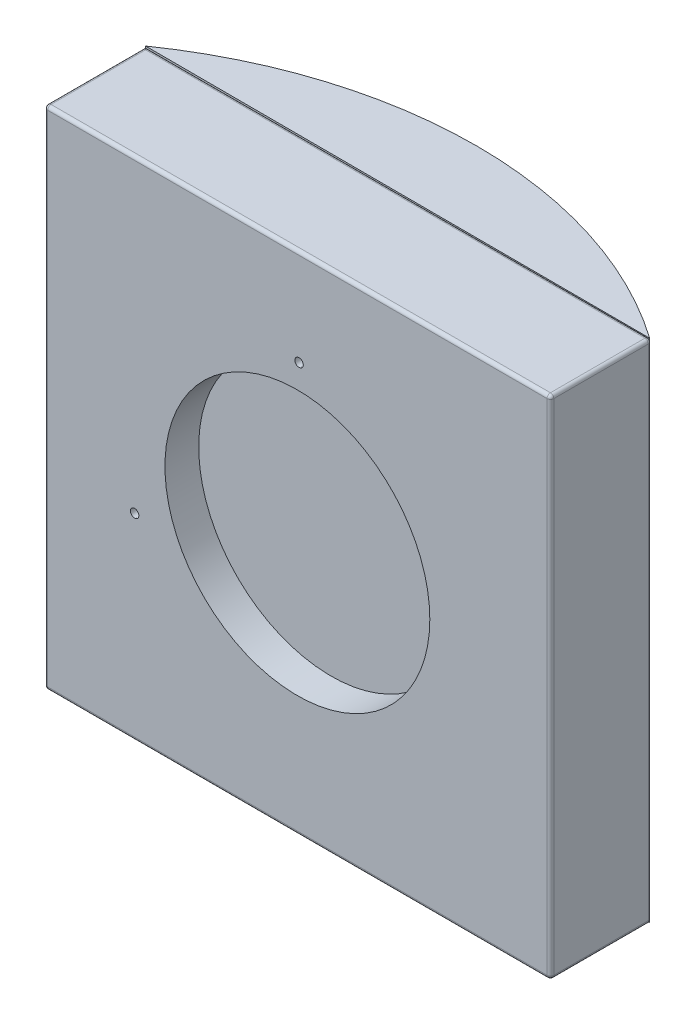
ISO-10303-21;
HEADER;
FILE_DESCRIPTION(('STEP AP214'),'2;1');
FILE_NAME('part.step','',(''),(''),'','','');
FILE_SCHEMA(('AUTOMOTIVE_DESIGN { 1 0 10303 214 1 1 1 1 }'));
ENDSEC;
DATA;
#1=APPLICATION_CONTEXT('core data for automotive mechanical design processes');
#2=APPLICATION_PROTOCOL_DEFINITION('international standard','automotive_design',2000,#1);
#3=PRODUCT_CONTEXT('',#1,'mechanical');
#4=PRODUCT('Part','Part','',(#3));
#5=PRODUCT_RELATED_PRODUCT_CATEGORY('part','',(#4));
#6=PRODUCT_DEFINITION_FORMATION('','',#4);
#7=PRODUCT_DEFINITION_CONTEXT('part definition',#1,'design');
#8=PRODUCT_DEFINITION('design','',#6,#7);
#9=PRODUCT_DEFINITION_SHAPE('','',#8);
#10=(LENGTH_UNIT() NAMED_UNIT(*) SI_UNIT(.MILLI.,.METRE.));
#11=(NAMED_UNIT(*) PLANE_ANGLE_UNIT() SI_UNIT($,.RADIAN.));
#12=(NAMED_UNIT(*) SI_UNIT($,.STERADIAN.) SOLID_ANGLE_UNIT());
#13=UNCERTAINTY_MEASURE_WITH_UNIT(LENGTH_MEASURE(1.E-05),#10,'distance_accuracy_value','');
#14=(GEOMETRIC_REPRESENTATION_CONTEXT(3) GLOBAL_UNCERTAINTY_ASSIGNED_CONTEXT((#13)) GLOBAL_UNIT_ASSIGNED_CONTEXT((#10,
#11,#12)) REPRESENTATION_CONTEXT('',''));
#15=CARTESIAN_POINT('',(0.,0.,0.));
#16=DIRECTION('',(0.,0.,1.));
#17=DIRECTION('',(1.,0.,0.));
#18=AXIS2_PLACEMENT_3D('',#15,#16,#17);
#19=CARTESIAN_POINT('',(74.,74.,-29.));
#20=DIRECTION('',(0.,1.,0.));
#21=DIRECTION('',(0.,0.,1.));
#22=AXIS2_PLACEMENT_3D('',#19,#20,#21);
#23=SPHERICAL_SURFACE('',#22,1.);
#24=CARTESIAN_POINT('',(74.4305291047432,73.9426271033344,-29.9007513756288));
#25=CARTESIAN_POINT('',(74.4278718002855,73.9517904499525,-29.9026067243922));
#26=CARTESIAN_POINT('',(74.4258625407038,73.9612301250531,-29.9040095217082));
#27=CARTESIAN_POINT('',(74.4231693323326,73.9803796203209,-29.9058897732701));
#28=CARTESIAN_POINT('',(74.4224843829785,73.990089230911,-29.9063679261186));
#29=CARTESIAN_POINT('',(74.4224649101891,74.0095152582604,-29.9063815148567));
#30=CARTESIAN_POINT('',(74.4231310111858,74.0192316760911,-29.9059165148374));
#31=CARTESIAN_POINT('',(74.4257929739684,74.0383874230766,-29.9040581007356));
#32=CARTESIAN_POINT('',(74.4277885681438,74.0478268075958,-29.9026648734936));
#33=CARTESIAN_POINT('',(74.4330515121115,74.0661618939257,-29.898990180103));
#34=CARTESIAN_POINT('',(74.4363187912206,74.0750576259223,-29.896708763322));
#35=CARTESIAN_POINT('',(74.4440308050954,74.0920557274952,-29.8913230360017));
#36=CARTESIAN_POINT('',(74.4484757284958,74.1001579696858,-29.8882185936304));
#37=CARTESIAN_POINT('',(74.4584175670713,74.1153440901568,-29.8812738230502));
#38=CARTESIAN_POINT('',(74.4639150765944,74.1224273891093,-29.8774330790832));
#39=CARTESIAN_POINT('',(74.4758026999076,74.1353719993852,-29.8691263891262));
#40=CARTESIAN_POINT('',(74.4821927689403,74.1412333719451,-29.8646604744854));
#41=CARTESIAN_POINT('',(74.4957086562992,74.151590852187,-29.8552124212487));
#42=CARTESIAN_POINT('',(74.5028370392789,74.156081971459,-29.8502284829871));
#43=CARTESIAN_POINT('',(74.5176081238788,74.163545935225,-29.8398986336474));
#44=CARTESIAN_POINT('',(74.5252508462641,74.1665187183782,-29.8345527079548));
#45=CARTESIAN_POINT('',(74.5408608471311,74.1708711230936,-29.8236312242814));
#46=CARTESIAN_POINT('',(74.5488291274053,74.1722453724311,-29.8180549568142));
#47=CARTESIAN_POINT('',(74.5648404515405,74.1733446195535,-29.8068473868675));
#48=CARTESIAN_POINT('',(74.5728834963299,74.173069596833,-29.8012160837046));
#49=CARTESIAN_POINT('',(74.588830406748,74.1708759903868,-29.7900482691596));
#50=CARTESIAN_POINT('',(74.5967340134067,74.1689546220742,-29.7845119345967));
#51=CARTESIAN_POINT('',(74.6121632554124,74.1635180012685,-29.7737015771849));
#52=CARTESIAN_POINT('',(74.6196888983268,74.1600027807014,-29.7684275490841));
#53=CARTESIAN_POINT('',(74.6341423103896,74.1514797546361,-29.7582963716963));
#54=CARTESIAN_POINT('',(74.6410705281354,74.1464730818552,-29.7534389096316));
#55=CARTESIAN_POINT('',(74.6541374768035,74.1351061096982,-29.7442758105373));
#56=CARTESIAN_POINT('',(74.6602761674178,74.1287457412553,-29.7399702016819));
#57=CARTESIAN_POINT('',(74.6715707545084,74.1148706125174,-29.7320470704562));
#58=CARTESIAN_POINT('',(74.6767293494936,74.1073591278767,-29.7284276588312));
#59=CARTESIAN_POINT('',(74.685935280188,74.0913826670844,-29.7219677375932));
#60=CARTESIAN_POINT('',(74.6899828107235,74.0829178584669,-29.7191270914229));
#61=CARTESIAN_POINT('',(74.696837146676,74.0653078278998,-29.714316159302));
#62=CARTESIAN_POINT('',(74.6996485057801,74.0561652506666,-29.7123426789892));
#63=CARTESIAN_POINT('',(74.7039718192039,74.0374303598477,-29.7093077165613));
#64=CARTESIAN_POINT('',(74.7054835436585,74.0278379670199,-29.708246395779));
#65=CARTESIAN_POINT('',(74.7071576110133,74.0085123955182,-29.707071102787));
#66=CARTESIAN_POINT('',(74.7073245333113,73.9987798077856,-29.7069539155594));
#67=CARTESIAN_POINT('',(74.7063239882313,73.9794103786518,-29.707656345545));
#68=CARTESIAN_POINT('',(74.705155489279,73.9697736170773,-29.7084766869721));
#69=CARTESIAN_POINT('',(74.7033206427212,73.9603267742203,-29.7097648263181));
#70=B_SPLINE_CURVE_WITH_KNOTS('',3,(#24,#25,#26,#27,#28,#29,#30,#31,#32,#33,#34,#35,#36,#37,#38,
#39,#40,#41,#42,#43,#44,#45,#46,#47,#48,#49,#50,#51,#52,#53,#54,#55,#56,#57,#58,#59,#60,#61,#62,
#63,#64,#65,#66,#67,#68,#69),.UNSPECIFIED.,.F.,.F.,(4,2,2,2,2,2,2,2,2,2,2,2,2,2,2,2,2,2,2,2,2,2,
4),(0.,0.0291201559340711,0.0582183019182402,0.0873298996247915,0.116435639298685,
0.145539761441217,0.174648548290671,0.20377382029324,0.232897632335231,0.262126238223692,
0.291356024854758,0.320683763367957,0.350011866514414,0.379389672602993,0.408766890259118,
0.438121853355839,0.467478314528448,0.496752738164597,0.526022025211897,0.555182570710872,
0.5843482727456,0.613414615892765,0.642503427133676),.UNSPECIFIED.);
#71=CARTESIAN_POINT('',(74.7071067811865,74.,-29.7071067811865));
#72=VERTEX_POINT('',#71);
#73=CARTESIAN_POINT('',(74.42247455372,74.,-29.9063747853173));
#74=VERTEX_POINT('',#73);
#75=EDGE_CURVE('E245',#72,#74,#70,.F.);
#76=ORIENTED_EDGE('',*,*,#75,.F.);
#77=CARTESIAN_POINT('',(74.,74.,-29.));
#78=DIRECTION('',(0.,1.,0.));
#79=DIRECTION('',(0.,0.,1.));
#80=AXIS2_PLACEMENT_3D('',#77,#78,#79);
#81=CIRCLE('',#80,1.);
#82=EDGE_CURVE('E316',#74,#72,#81,.F.);
#83=ORIENTED_EDGE('',*,*,#82,.F.);
#84=EDGE_LOOP('',(#76,#83));
#85=FACE_BOUND('',#84,.T.);
#86=ADVANCED_FACE('F41',(#85),#23,.T.);
#87=CARTESIAN_POINT('',(74.,-74.,-30.));
#88=DIRECTION('',(0.,0.,1.));
#89=DIRECTION('',(1.,0.,0.));
#90=AXIS2_PLACEMENT_3D('',#87,#88,#89);
#91=CYLINDRICAL_SURFACE('',#90,1.);
#92=CARTESIAN_POINT('',(74.0376484217508,-74.9992910468626,-30.174));
#93=CARTESIAN_POINT('',(74.1085266238928,-74.9966066602398,-30.1249014323537));
#94=CARTESIAN_POINT('',(74.1793009440295,-74.9863937068158,-30.0757612489331));
#95=CARTESIAN_POINT('',(74.3160348463956,-74.9512972572264,-29.9806329564631));
#96=CARTESIAN_POINT('',(74.3820750407225,-74.9268595873546,-29.9345945603016));
#97=CARTESIAN_POINT('',(74.4921868254143,-74.87203781748,-29.8576894517446));
#98=CARTESIAN_POINT('',(74.5373985806045,-74.8450084510917,-29.8260663272199));
#99=CARTESIAN_POINT('',(74.6250254363569,-74.7824962823509,-29.76470073019));
#100=CARTESIAN_POINT('',(74.6673551849175,-74.7468376530168,-29.7350162662021));
#101=CARTESIAN_POINT('',(74.7071067811866,-74.7071067811865,-29.7071067811865));
#102=B_SPLINE_CURVE_WITH_KNOTS('',3,(#92,#93,#94,#95,#96,#97,#98,#99,#100,#101),.UNSPECIFIED.,
.F.,.F.,(4,2,2,2,4),(0.,0.258756501097866,0.509809262671669,0.693502415615878,
0.881311113694212),.UNSPECIFIED.);
#103=CARTESIAN_POINT('',(74.4224745537198,-74.9063747853175,-29.9063747853174));
#104=VERTEX_POINT('',#103);
#105=CARTESIAN_POINT('',(74.7071067811865,-74.7071067811865,-29.7071067811865));
#106=VERTEX_POINT('',#105);
#107=EDGE_CURVE('E11',#104,#106,#102,.T.);
#108=ORIENTED_EDGE('',*,*,#107,.F.);
#109=CARTESIAN_POINT('',(74.,-74.,-29.));
#110=DIRECTION('',(0.,-0.707106781186547,0.707106781186547));
#111=DIRECTION('',(0.,-0.707106781186547,-0.707106781186547));
#112=AXIS2_PLACEMENT_3D('',#109,#110,#111);
#113=ELLIPSE('',#112,1.41421356237309,1.);
#114=EDGE_CURVE('E522',#104,#106,#113,.T.);
#115=ORIENTED_EDGE('',*,*,#114,.T.);
#116=EDGE_LOOP('',(#108,#115));
#117=FACE_BOUND('',#116,.T.);
#118=ADVANCED_FACE('F304',(#117),#91,.T.);
#119=CARTESIAN_POINT('',(-75.,-75.,-30.));
#120=DIRECTION('',(0.,-1.,0.));
#121=DIRECTION('',(0.,0.,-1.));
#122=AXIS2_PLACEMENT_3D('',#119,#120,#121);
#123=PLANE('',#122);
#124=DIRECTION('',(0.,0.,1.));
#125=VECTOR('',#124,1.);
#126=CARTESIAN_POINT('',(-74.,-75.,-30.));
#127=LINE('',#126,#125);
#128=CARTESIAN_POINT('',(-74.,-75.,-1.));
#129=VERTEX_POINT('',#128);
#130=CARTESIAN_POINT('',(-74.,-75.,-29.9980435583513));
#131=VERTEX_POINT('',#130);
#132=EDGE_CURVE('E547',#129,#131,#127,.F.);
#133=ORIENTED_EDGE('',*,*,#132,.T.);
#134=DIRECTION('',(-0.999998086173532,0.,-0.0019564379044126));
#135=VECTOR('',#134,1.);
#136=CARTESIAN_POINT('',(-75.,-75.,-30.));
#137=LINE('',#136,#135);
#138=CARTESIAN_POINT('',(-75.,-75.,-30.));
#139=VERTEX_POINT('',#138);
#140=EDGE_CURVE('E203',#131,#139,#137,.T.);
#141=ORIENTED_EDGE('',*,*,#140,.T.);
#142=CARTESIAN_POINT('',(-0.355908566276825,-75.,77.2091627445867));
#143=DIRECTION('',(0.,-1.,0.));
#144=DIRECTION('',(0.,0.,-1.));
#145=AXIS2_PLACEMENT_3D('',#142,#143,#144);
#146=CIRCLE('',#145,130.635159747907);
#147=CARTESIAN_POINT('',(74.7071067811865,-75.,-29.7071067811865));
#148=VERTEX_POINT('',#147);
#149=EDGE_CURVE('E195',#139,#148,#146,.T.);
#150=ORIENTED_EDGE('',*,*,#149,.T.);
#151=CARTESIAN_POINT('',(74.,-75.,-29.7084901943433));
#152=VERTEX_POINT('',#151);
#153=EDGE_CURVE('E64',#148,#152,#137,.T.);
#154=ORIENTED_EDGE('',*,*,#153,.T.);
#155=DIRECTION('',(0.,0.,1.));
#156=VECTOR('',#155,1.);
#157=CARTESIAN_POINT('',(74.,-75.,-30.));
#158=LINE('',#157,#156);
#159=CARTESIAN_POINT('',(74.,-75.,-1.));
#160=VERTEX_POINT('',#159);
#161=EDGE_CURVE('E538',#152,#160,#158,.T.);
#162=ORIENTED_EDGE('',*,*,#161,.T.);
#163=DIRECTION('',(1.,0.,0.));
#164=VECTOR('',#163,1.);
#165=CARTESIAN_POINT('',(-75.,-75.,-1.));
#166=LINE('',#165,#164);
#167=EDGE_CURVE('E598',#160,#129,#166,.F.);
#168=ORIENTED_EDGE('',*,*,#167,.T.);
#169=EDGE_LOOP('',(#133,#141,#150,#154,#162,#168));
#170=FACE_BOUND('',#169,.T.);
#171=ADVANCED_FACE('F309',(#170),#123,.T.);
#172=CARTESIAN_POINT('',(-75.,-75.,-30.));
#173=DIRECTION('',(1.,0.,0.));
#174=DIRECTION('',(0.,0.,-1.));
#175=AXIS2_PLACEMENT_3D('',#172,#173,#174);
#176=PLANE('',#175);
#177=DIRECTION('',(0.,1.,0.));
#178=VECTOR('',#177,1.);
#179=CARTESIAN_POINT('',(-75.,-75.,-30.));
#180=LINE('',#179,#178);
#181=CARTESIAN_POINT('',(-75.,-74.,-30.));
#182=VERTEX_POINT('',#181);
#183=CARTESIAN_POINT('',(-74.9999999999996,74.,-30.));
#184=VERTEX_POINT('',#183);
#185=EDGE_CURVE('E381',#182,#184,#180,.T.);
#186=ORIENTED_EDGE('',*,*,#185,.F.);
#187=DIRECTION('',(0.,0.,1.));
#188=VECTOR('',#187,1.);
#189=CARTESIAN_POINT('',(-75.,-74.,0.));
#190=LINE('',#189,#188);
#191=CARTESIAN_POINT('',(-75.,-74.,-1.));
#192=VERTEX_POINT('',#191);
#193=EDGE_CURVE('E621',#182,#192,#190,.T.);
#194=ORIENTED_EDGE('',*,*,#193,.T.);
#195=DIRECTION('',(0.,1.,0.));
#196=VECTOR('',#195,1.);
#197=CARTESIAN_POINT('',(-75.,75.,-1.));
#198=LINE('',#197,#196);
#199=CARTESIAN_POINT('',(-75.,74.,-1.));
#200=VERTEX_POINT('',#199);
#201=EDGE_CURVE('E614',#192,#200,#198,.T.);
#202=ORIENTED_EDGE('',*,*,#201,.T.);
#203=DIRECTION('',(0.,0.,1.));
#204=VECTOR('',#203,1.);
#205=CARTESIAN_POINT('',(-75.,74.,-30.));
#206=LINE('',#205,#204);
#207=EDGE_CURVE('E617',#200,#184,#206,.F.);
#208=ORIENTED_EDGE('',*,*,#207,.T.);
#209=EDGE_LOOP('',(#186,#194,#202,#208));
#210=FACE_BOUND('',#209,.T.);
#211=ADVANCED_FACE('F459',(#210),#176,.F.);
#212=CARTESIAN_POINT('',(-75.,75.,-30.));
#213=DIRECTION('',(0.,-1.,0.));
#214=DIRECTION('',(0.,0.,-1.));
#215=AXIS2_PLACEMENT_3D('',#212,#213,#214);
#216=PLANE('',#215);
#217=DIRECTION('',(1.,0.,0.));
#218=VECTOR('',#217,1.);
#219=CARTESIAN_POINT('',(-75.,75.,-29.));
#220=LINE('',#219,#218);
#221=CARTESIAN_POINT('',(74.,75.,-29.));
#222=VERTEX_POINT('',#221);
#223=CARTESIAN_POINT('',(-74.,75.,-29.));
#224=VERTEX_POINT('',#223);
#225=EDGE_CURVE('E507',#222,#224,#220,.F.);
#226=ORIENTED_EDGE('',*,*,#225,.T.);
#227=DIRECTION('',(0.,0.,1.));
#228=VECTOR('',#227,1.);
#229=CARTESIAN_POINT('',(-74.,75.,-30.));
#230=LINE('',#229,#228);
#231=CARTESIAN_POINT('',(-74.,75.,-1.));
#232=VERTEX_POINT('',#231);
#233=EDGE_CURVE('E501',#224,#232,#230,.T.);
#234=ORIENTED_EDGE('',*,*,#233,.T.);
#235=DIRECTION('',(1.,0.,0.));
#236=VECTOR('',#235,1.);
#237=CARTESIAN_POINT('',(75.,75.,-1.));
#238=LINE('',#237,#236);
#239=CARTESIAN_POINT('',(74.,75.,-1.));
#240=VERTEX_POINT('',#239);
#241=EDGE_CURVE('E496',#232,#240,#238,.T.);
#242=ORIENTED_EDGE('',*,*,#241,.T.);
#243=DIRECTION('',(0.,0.,1.));
#244=VECTOR('',#243,1.);
#245=CARTESIAN_POINT('',(74.,75.,-30.));
#246=LINE('',#245,#244);
#247=EDGE_CURVE('E626',#240,#222,#246,.F.);
#248=ORIENTED_EDGE('',*,*,#247,.T.);
#249=EDGE_LOOP('',(#226,#234,#242,#248));
#250=FACE_BOUND('',#249,.T.);
#251=ADVANCED_FACE('F462',(#250),#216,.F.);
#252=CARTESIAN_POINT('',(75.,-75.,-30.));
#253=DIRECTION('',(1.,0.,0.));
#254=DIRECTION('',(0.,0.,-1.));
#255=AXIS2_PLACEMENT_3D('',#252,#253,#254);
#256=PLANE('',#255);
#257=DIRECTION('',(0.,1.,0.));
#258=VECTOR('',#257,1.);
#259=CARTESIAN_POINT('',(75.,-75.,-1.));
#260=LINE('',#259,#258);
#261=CARTESIAN_POINT('',(75.,74.,-1.));
#262=VERTEX_POINT('',#261);
#263=CARTESIAN_POINT('',(75.,-74.,-1.));
#264=VERTEX_POINT('',#263);
#265=EDGE_CURVE('E492',#262,#264,#260,.F.);
#266=ORIENTED_EDGE('',*,*,#265,.T.);
#267=DIRECTION('',(0.,0.,1.));
#268=VECTOR('',#267,1.);
#269=CARTESIAN_POINT('',(75.,-74.,-30.));
#270=LINE('',#269,#268);
#271=CARTESIAN_POINT('',(75.,-74.,-29.));
#272=VERTEX_POINT('',#271);
#273=EDGE_CURVE('E536',#264,#272,#270,.F.);
#274=ORIENTED_EDGE('',*,*,#273,.T.);
#275=DIRECTION('',(0.,1.,0.));
#276=VECTOR('',#275,1.);
#277=CARTESIAN_POINT('',(75.,75.,-29.));
#278=LINE('',#277,#276);
#279=CARTESIAN_POINT('',(75.,74.,-29.));
#280=VERTEX_POINT('',#279);
#281=EDGE_CURVE('E532',#272,#280,#278,.T.);
#282=ORIENTED_EDGE('',*,*,#281,.T.);
#283=DIRECTION('',(0.,0.,1.));
#284=VECTOR('',#283,1.);
#285=CARTESIAN_POINT('',(75.,74.,0.));
#286=LINE('',#285,#284);
#287=EDGE_CURVE('E607',#280,#262,#286,.T.);
#288=ORIENTED_EDGE('',*,*,#287,.T.);
#289=EDGE_LOOP('',(#266,#274,#282,#288));
#290=FACE_BOUND('',#289,.T.);
#291=ADVANCED_FACE('F457',(#290),#256,.T.);
#292=CARTESIAN_POINT('',(0.,0.,0.));
#293=DIRECTION('',(0.,0.,1.));
#294=DIRECTION('',(1.,0.,0.));
#295=AXIS2_PLACEMENT_3D('',#292,#293,#294);
#296=PLANE('',#295);
#297=CARTESIAN_POINT('',(0.496213053365321,46.5,0.));
#298=DIRECTION('',(0.,0.,1.));
#299=DIRECTION('',(1.,0.,0.));
#300=AXIS2_PLACEMENT_3D('',#297,#298,#299);
#301=CIRCLE('',#300,1.24999999999999);
#302=CARTESIAN_POINT('',(1.74621305336531,46.5,0.));
#303=VERTEX_POINT('',#302);
#304=EDGE_CURVE('E182',#303,#303,#301,.T.);
#305=ORIENTED_EDGE('',*,*,#304,.F.);
#306=EDGE_LOOP('',(#305));
#307=FACE_BOUND('',#306,.T.);
#308=CARTESIAN_POINT('',(-48.2375471335506,-16.5472529741879,0.));
#309=DIRECTION('',(0.,0.,1.));
#310=DIRECTION('',(1.,0.,0.));
#311=AXIS2_PLACEMENT_3D('',#308,#309,#310);
#312=CIRCLE('',#311,1.24999999999999);
#313=CARTESIAN_POINT('',(-46.9875471335506,-16.5472529741879,0.));
#314=VERTEX_POINT('',#313);
#315=EDGE_CURVE('E181',#314,#314,#312,.T.);
#316=ORIENTED_EDGE('',*,*,#315,.F.);
#317=EDGE_LOOP('',(#316));
#318=FACE_BOUND('',#317,.T.);
#319=CARTESIAN_POINT('',(0.,0.,0.));
#320=DIRECTION('',(0.,0.,1.));
#321=DIRECTION('',(1.,0.,0.));
#322=AXIS2_PLACEMENT_3D('',#319,#320,#321);
#323=CIRCLE('',#322,39.25);
#324=CARTESIAN_POINT('',(39.25,0.,0.));
#325=VERTEX_POINT('',#324);
#326=EDGE_CURVE('E586',#325,#325,#323,.T.);
#327=ORIENTED_EDGE('',*,*,#326,.F.);
#328=EDGE_LOOP('',(#327));
#329=FACE_BOUND('',#328,.T.);
#330=DIRECTION('',(0.,1.,0.));
#331=VECTOR('',#330,1.);
#332=CARTESIAN_POINT('',(-74.,-75.,0.));
#333=LINE('',#332,#331);
#334=CARTESIAN_POINT('',(-74.,74.,0.));
#335=VERTEX_POINT('',#334);
#336=CARTESIAN_POINT('',(-74.,-74.,0.));
#337=VERTEX_POINT('',#336);
#338=EDGE_CURVE('E72',#335,#337,#333,.F.);
#339=ORIENTED_EDGE('',*,*,#338,.T.);
#340=DIRECTION('',(1.,0.,0.));
#341=VECTOR('',#340,1.);
#342=CARTESIAN_POINT('',(0.,-74.,0.));
#343=LINE('',#342,#341);
#344=CARTESIAN_POINT('',(74.,-74.,0.));
#345=VERTEX_POINT('',#344);
#346=EDGE_CURVE('E57',#337,#345,#343,.T.);
#347=ORIENTED_EDGE('',*,*,#346,.T.);
#348=DIRECTION('',(0.,1.,0.));
#349=VECTOR('',#348,1.);
#350=CARTESIAN_POINT('',(74.,0.,0.));
#351=LINE('',#350,#349);
#352=CARTESIAN_POINT('',(74.,74.,0.));
#353=VERTEX_POINT('',#352);
#354=EDGE_CURVE('E491',#345,#353,#351,.T.);
#355=ORIENTED_EDGE('',*,*,#354,.T.);
#356=DIRECTION('',(1.,0.,0.));
#357=VECTOR('',#356,1.);
#358=CARTESIAN_POINT('',(-75.,74.,0.));
#359=LINE('',#358,#357);
#360=EDGE_CURVE('E498',#353,#335,#359,.F.);
#361=ORIENTED_EDGE('',*,*,#360,.T.);
#362=EDGE_LOOP('',(#339,#347,#355,#361));
#363=FACE_BOUND('',#362,.T.);
#364=ADVANCED_FACE('F300',(#307,#318,#329,#363),#296,.T.);
#365=CARTESIAN_POINT('',(-74.,74.,-1.));
#366=DIRECTION('',(-1.,0.,0.));
#367=DIRECTION('',(0.,0.,1.));
#368=AXIS2_PLACEMENT_3D('',#365,#366,#367);
#369=SPHERICAL_SURFACE('',#368,1.);
#370=CARTESIAN_POINT('',(-74.,74.,-1.));
#371=DIRECTION('',(-1.,0.,0.));
#372=DIRECTION('',(0.,0.,1.));
#373=AXIS2_PLACEMENT_3D('',#370,#371,#372);
#374=CIRCLE('',#373,1.);
#375=EDGE_CURVE('E371',#232,#335,#374,.F.);
#376=ORIENTED_EDGE('',*,*,#375,.F.);
#377=CARTESIAN_POINT('',(-74.,74.,-1.));
#378=DIRECTION('',(0.,0.,1.));
#379=DIRECTION('',(1.,0.,0.));
#380=AXIS2_PLACEMENT_3D('',#377,#378,#379);
#381=CIRCLE('',#380,1.);
#382=EDGE_CURVE('E379',#200,#232,#381,.F.);
#383=ORIENTED_EDGE('',*,*,#382,.F.);
#384=CARTESIAN_POINT('',(-74.,74.,-1.));
#385=DIRECTION('',(0.,1.,0.));
#386=DIRECTION('',(0.,0.,1.));
#387=AXIS2_PLACEMENT_3D('',#384,#385,#386);
#388=CIRCLE('',#387,1.);
#389=EDGE_CURVE('E375',#335,#200,#388,.F.);
#390=ORIENTED_EDGE('',*,*,#389,.F.);
#391=EDGE_LOOP('',(#376,#383,#390));
#392=FACE_BOUND('',#391,.T.);
#393=ADVANCED_FACE('F43',(#392),#369,.T.);
#394=CARTESIAN_POINT('',(-74.,74.,-30.));
#395=DIRECTION('',(0.,0.,1.));
#396=DIRECTION('',(1.,0.,0.));
#397=AXIS2_PLACEMENT_3D('',#394,#395,#396);
#398=CYLINDRICAL_SURFACE('',#397,1.);
#399=ORIENTED_EDGE('',*,*,#382,.T.);
#400=ORIENTED_EDGE('',*,*,#233,.F.);
#401=CARTESIAN_POINT('',(-74.,74.,-29.));
#402=DIRECTION('',(0.707106781186547,0.,-0.707106781186547));
#403=DIRECTION('',(0.707106781186547,0.,0.707106781186547));
#404=AXIS2_PLACEMENT_3D('',#401,#402,#403);
#405=ELLIPSE('',#404,1.41421356237309,1.);
#406=EDGE_CURVE('E367',#184,#224,#405,.T.);
#407=ORIENTED_EDGE('',*,*,#406,.F.);
#408=ORIENTED_EDGE('',*,*,#207,.F.);
#409=EDGE_LOOP('',(#399,#400,#407,#408));
#410=FACE_BOUND('',#409,.T.);
#411=ADVANCED_FACE('F293',(#410),#398,.T.);
#412=CARTESIAN_POINT('',(-74.,-74.,-30.));
#413=DIRECTION('',(0.,0.,-1.));
#414=DIRECTION('',(-1.,0.,0.));
#415=AXIS2_PLACEMENT_3D('',#412,#413,#414);
#416=CYLINDRICAL_SURFACE('',#415,1.);
#417=CARTESIAN_POINT('',(-74.,-74.,-29.9980435583513));
#418=DIRECTION('',(-0.0019564379044126,0.,0.999998086173532));
#419=DIRECTION('',(-0.999998086173532,0.,-0.0019564379044126));
#420=AXIS2_PLACEMENT_3D('',#417,#418,#419);
#421=ELLIPSE('',#420,1.00000191383013,1.);
#422=EDGE_CURVE('E239',#131,#182,#421,.F.);
#423=ORIENTED_EDGE('',*,*,#422,.F.);
#424=ORIENTED_EDGE('',*,*,#132,.F.);
#425=CARTESIAN_POINT('',(-74.,-74.,-1.));
#426=DIRECTION('',(0.,0.,1.));
#427=DIRECTION('',(0.,-1.,0.));
#428=AXIS2_PLACEMENT_3D('',#425,#426,#427);
#429=CIRCLE('',#428,1.);
#430=EDGE_CURVE('E363',#192,#129,#429,.T.);
#431=ORIENTED_EDGE('',*,*,#430,.F.);
#432=ORIENTED_EDGE('',*,*,#193,.F.);
#433=EDGE_LOOP('',(#423,#424,#431,#432));
#434=FACE_BOUND('',#433,.T.);
#435=ADVANCED_FACE('F290',(#434),#416,.T.);
#436=CARTESIAN_POINT('',(-74.,-75.,-1.));
#437=DIRECTION('',(0.,-1.,0.));
#438=DIRECTION('',(0.,0.,-1.));
#439=AXIS2_PLACEMENT_3D('',#436,#437,#438);
#440=CYLINDRICAL_SURFACE('',#439,1.);
#441=ORIENTED_EDGE('',*,*,#389,.T.);
#442=ORIENTED_EDGE('',*,*,#201,.F.);
#443=CARTESIAN_POINT('',(-74.,-74.,-1.));
#444=DIRECTION('',(0.,-1.,0.));
#445=DIRECTION('',(0.,0.,-1.));
#446=AXIS2_PLACEMENT_3D('',#443,#444,#445);
#447=CIRCLE('',#446,1.);
#448=EDGE_CURVE('E359',#337,#192,#447,.T.);
#449=ORIENTED_EDGE('',*,*,#448,.F.);
#450=ORIENTED_EDGE('',*,*,#338,.F.);
#451=EDGE_LOOP('',(#441,#442,#449,#450));
#452=FACE_BOUND('',#451,.T.);
#453=ADVANCED_FACE('F286',(#452),#440,.T.);
#454=CARTESIAN_POINT('',(-75.,74.,-1.));
#455=DIRECTION('',(-1.,0.,0.));
#456=DIRECTION('',(0.,0.,1.));
#457=AXIS2_PLACEMENT_3D('',#454,#455,#456);
#458=CYLINDRICAL_SURFACE('',#457,1.);
#459=ORIENTED_EDGE('',*,*,#375,.T.);
#460=ORIENTED_EDGE('',*,*,#360,.F.);
#461=CARTESIAN_POINT('',(74.,74.,-1.));
#462=DIRECTION('',(1.,0.,0.));
#463=DIRECTION('',(0.,0.,-1.));
#464=AXIS2_PLACEMENT_3D('',#461,#462,#463);
#465=CIRCLE('',#464,1.);
#466=EDGE_CURVE('E355',#240,#353,#465,.T.);
#467=ORIENTED_EDGE('',*,*,#466,.F.);
#468=ORIENTED_EDGE('',*,*,#241,.F.);
#469=EDGE_LOOP('',(#459,#460,#467,#468));
#470=FACE_BOUND('',#469,.T.);
#471=ADVANCED_FACE('F282',(#470),#458,.T.);
#472=CARTESIAN_POINT('',(74.,74.,-30.));
#473=DIRECTION('',(0.,0.,-1.));
#474=DIRECTION('',(-1.,0.,0.));
#475=AXIS2_PLACEMENT_3D('',#472,#473,#474);
#476=CYLINDRICAL_SURFACE('',#475,1.);
#477=CARTESIAN_POINT('',(74.,74.,-29.));
#478=DIRECTION('',(0.,0.,-1.));
#479=DIRECTION('',(-1.,0.,0.));
#480=AXIS2_PLACEMENT_3D('',#477,#478,#479);
#481=CIRCLE('',#480,1.);
#482=EDGE_CURVE('E324',#222,#280,#481,.T.);
#483=ORIENTED_EDGE('',*,*,#482,.F.);
#484=ORIENTED_EDGE('',*,*,#247,.F.);
#485=CARTESIAN_POINT('',(74.,74.,-1.));
#486=DIRECTION('',(0.,0.,1.));
#487=DIRECTION('',(0.,-1.,0.));
#488=AXIS2_PLACEMENT_3D('',#485,#486,#487);
#489=CIRCLE('',#488,1.);
#490=EDGE_CURVE('E351',#262,#240,#489,.T.);
#491=ORIENTED_EDGE('',*,*,#490,.F.);
#492=ORIENTED_EDGE('',*,*,#287,.F.);
#493=EDGE_LOOP('',(#483,#484,#491,#492));
#494=FACE_BOUND('',#493,.T.);
#495=ADVANCED_FACE('F278',(#494),#476,.T.);
#496=CARTESIAN_POINT('',(0.,74.,-29.));
#497=DIRECTION('',(1.,0.,0.));
#498=DIRECTION('',(0.,0.,-1.));
#499=AXIS2_PLACEMENT_3D('',#496,#497,#498);
#500=CYLINDRICAL_SURFACE('',#499,1.);
#501=CARTESIAN_POINT('',(436.132034355965,74.,-29.));
#502=DIRECTION('',(-0.0019564379044126,0.,0.999998086173532));
#503=DIRECTION('',(0.999998086173532,0.,0.0019564379044126));
#504=AXIS2_PLACEMENT_3D('',#501,#502,#503);
#505=ELLIPSE('',#504,511.133012575853,1.);
#506=CARTESIAN_POINT('',(74.,74.7057206561518,-29.7084901943433));
#507=VERTEX_POINT('',#506);
#508=EDGE_CURVE('E236',#184,#507,#505,.F.);
#509=ORIENTED_EDGE('',*,*,#508,.F.);
#510=ORIENTED_EDGE('',*,*,#406,.T.);
#511=ORIENTED_EDGE('',*,*,#225,.F.);
#512=CARTESIAN_POINT('',(74.,74.,-29.));
#513=DIRECTION('',(1.,0.,0.));
#514=DIRECTION('',(0.,0.,-1.));
#515=AXIS2_PLACEMENT_3D('',#512,#513,#514);
#516=CIRCLE('',#515,1.);
#517=EDGE_CURVE('E346',#507,#222,#516,.T.);
#518=ORIENTED_EDGE('',*,*,#517,.F.);
#519=EDGE_LOOP('',(#509,#510,#511,#518));
#520=FACE_BOUND('',#519,.T.);
#521=ADVANCED_FACE('F274',(#520),#500,.T.);
#522=CARTESIAN_POINT('',(-74.,-74.,-1.));
#523=DIRECTION('',(-1.,0.,0.));
#524=DIRECTION('',(0.,0.,1.));
#525=AXIS2_PLACEMENT_3D('',#522,#523,#524);
#526=SPHERICAL_SURFACE('',#525,1.);
#527=ORIENTED_EDGE('',*,*,#448,.T.);
#528=ORIENTED_EDGE('',*,*,#430,.T.);
#529=CARTESIAN_POINT('',(-74.,-74.,-1.));
#530=DIRECTION('',(-1.,0.,0.));
#531=DIRECTION('',(0.,0.,1.));
#532=AXIS2_PLACEMENT_3D('',#529,#530,#531);
#533=CIRCLE('',#532,1.);
#534=EDGE_CURVE('E338',#337,#129,#533,.F.);
#535=ORIENTED_EDGE('',*,*,#534,.F.);
#536=EDGE_LOOP('',(#527,#528,#535));
#537=FACE_BOUND('',#536,.T.);
#538=ADVANCED_FACE('F270',(#537),#526,.T.);
#539=CARTESIAN_POINT('',(74.,74.,-1.));
#540=DIRECTION('',(0.,1.,0.));
#541=DIRECTION('',(0.,0.,1.));
#542=AXIS2_PLACEMENT_3D('',#539,#540,#541);
#543=SPHERICAL_SURFACE('',#542,1.);
#544=ORIENTED_EDGE('',*,*,#490,.T.);
#545=ORIENTED_EDGE('',*,*,#466,.T.);
#546=CARTESIAN_POINT('',(74.,74.,-1.));
#547=DIRECTION('',(0.,1.,0.));
#548=DIRECTION('',(0.,0.,1.));
#549=AXIS2_PLACEMENT_3D('',#546,#547,#548);
#550=CIRCLE('',#549,1.);
#551=EDGE_CURVE('E335',#262,#353,#550,.F.);
#552=ORIENTED_EDGE('',*,*,#551,.F.);
#553=EDGE_LOOP('',(#544,#545,#552));
#554=FACE_BOUND('',#553,.T.);
#555=ADVANCED_FACE('F265',(#554),#543,.T.);
#556=CARTESIAN_POINT('',(74.0013861144183,74.,-29.7084874824914));
#557=DIRECTION('',(-0.0019564379044126,0.,0.999998086173532));
#558=DIRECTION('',(0.999998086173532,0.,0.0019564379044126));
#559=AXIS2_PLACEMENT_3D('',#556,#557,#558);
#560=CIRCLE('',#559,0.705722017397693);
#561=EDGE_CURVE('E233',#507,#72,#560,.F.);
#562=ORIENTED_EDGE('',*,*,#561,.F.);
#563=ORIENTED_EDGE('',*,*,#517,.T.);
#564=ORIENTED_EDGE('',*,*,#482,.T.);
#565=EDGE_CURVE('E321',#72,#280,#81,.F.);
#566=ORIENTED_EDGE('',*,*,#565,.F.);
#567=EDGE_LOOP('',(#562,#563,#564,#566));
#568=FACE_BOUND('',#567,.T.);
#569=ADVANCED_FACE('F259',(#568),#23,.T.);
#570=CARTESIAN_POINT('',(0.,-74.,-1.));
#571=DIRECTION('',(1.,0.,0.));
#572=DIRECTION('',(0.,0.,-1.));
#573=AXIS2_PLACEMENT_3D('',#570,#571,#572);
#574=CYLINDRICAL_SURFACE('',#573,1.);
#575=ORIENTED_EDGE('',*,*,#534,.T.);
#576=ORIENTED_EDGE('',*,*,#167,.F.);
#577=CARTESIAN_POINT('',(74.,-74.,-1.));
#578=DIRECTION('',(1.,0.,0.));
#579=DIRECTION('',(0.,0.,-1.));
#580=AXIS2_PLACEMENT_3D('',#577,#578,#579);
#581=CIRCLE('',#580,1.);
#582=EDGE_CURVE('E329',#345,#160,#581,.T.);
#583=ORIENTED_EDGE('',*,*,#582,.F.);
#584=ORIENTED_EDGE('',*,*,#346,.F.);
#585=EDGE_LOOP('',(#575,#576,#583,#584));
#586=FACE_BOUND('',#585,.T.);
#587=ADVANCED_FACE('F264',(#586),#574,.T.);
#588=CARTESIAN_POINT('',(74.,0.,-1.));
#589=DIRECTION('',(0.,1.,0.));
#590=DIRECTION('',(0.,0.,1.));
#591=AXIS2_PLACEMENT_3D('',#588,#589,#590);
#592=CYLINDRICAL_SURFACE('',#591,1.);
#593=ORIENTED_EDGE('',*,*,#551,.T.);
#594=ORIENTED_EDGE('',*,*,#354,.F.);
#595=CARTESIAN_POINT('',(74.,-74.,-1.));
#596=DIRECTION('',(0.,-1.,0.));
#597=DIRECTION('',(0.,0.,-1.));
#598=AXIS2_PLACEMENT_3D('',#595,#596,#597);
#599=CIRCLE('',#598,1.);
#600=EDGE_CURVE('E523',#264,#345,#599,.T.);
#601=ORIENTED_EDGE('',*,*,#600,.F.);
#602=ORIENTED_EDGE('',*,*,#265,.F.);
#603=EDGE_LOOP('',(#593,#594,#601,#602));
#604=FACE_BOUND('',#603,.T.);
#605=ADVANCED_FACE('F480',(#604),#592,.T.);
#606=CARTESIAN_POINT('',(74.,-75.,-29.));
#607=DIRECTION('',(0.,-1.,0.));
#608=DIRECTION('',(0.,0.,-1.));
#609=AXIS2_PLACEMENT_3D('',#606,#607,#608);
#610=CYLINDRICAL_SURFACE('',#609,1.);
#611=EDGE_CURVE('E519',#106,#272,#113,.T.);
#612=ORIENTED_EDGE('',*,*,#611,.F.);
#613=ORIENTED_EDGE('',*,*,#114,.F.);
#614=DIRECTION('',(0.,-1.,0.));
#615=VECTOR('',#614,1.);
#616=CARTESIAN_POINT('',(74.42247455372,0.,-29.9063747853173));
#617=LINE('',#616,#615);
#618=EDGE_CURVE('E242',#74,#104,#617,.T.);
#619=ORIENTED_EDGE('',*,*,#618,.F.);
#620=ORIENTED_EDGE('',*,*,#82,.T.);
#621=ORIENTED_EDGE('',*,*,#565,.T.);
#622=ORIENTED_EDGE('',*,*,#281,.F.);
#623=EDGE_LOOP('',(#612,#613,#619,#620,#621,#622));
#624=FACE_BOUND('',#623,.T.);
#625=ADVANCED_FACE('F332',(#624),#610,.T.);
#626=CARTESIAN_POINT('',(74.,-74.,-1.));
#627=DIRECTION('',(0.,0.,1.));
#628=DIRECTION('',(1.,0.,0.));
#629=AXIS2_PLACEMENT_3D('',#626,#627,#628);
#630=SPHERICAL_SURFACE('',#629,1.);
#631=ORIENTED_EDGE('',*,*,#600,.T.);
#632=ORIENTED_EDGE('',*,*,#582,.T.);
#633=CARTESIAN_POINT('',(74.,-74.,-1.));
#634=DIRECTION('',(0.,0.,1.));
#635=DIRECTION('',(1.,0.,0.));
#636=AXIS2_PLACEMENT_3D('',#633,#634,#635);
#637=CIRCLE('',#636,1.);
#638=EDGE_CURVE('E515',#264,#160,#637,.F.);
#639=ORIENTED_EDGE('',*,*,#638,.F.);
#640=EDGE_LOOP('',(#631,#632,#639));
#641=FACE_BOUND('',#640,.T.);
#642=ADVANCED_FACE('F474',(#641),#630,.T.);
#643=CARTESIAN_POINT('',(74.,-74.,-29.7084901943433));
#644=DIRECTION('',(-0.0019564379044126,0.,0.999998086173532));
#645=DIRECTION('',(0.999998086173532,0.,0.0019564379044126));
#646=AXIS2_PLACEMENT_3D('',#643,#644,#645);
#647=ELLIPSE('',#646,1.00000191383013,1.);
#648=EDGE_CURVE('E230',#106,#152,#647,.F.);
#649=ORIENTED_EDGE('',*,*,#648,.F.);
#650=ORIENTED_EDGE('',*,*,#611,.T.);
#651=ORIENTED_EDGE('',*,*,#273,.F.);
#652=ORIENTED_EDGE('',*,*,#638,.T.);
#653=ORIENTED_EDGE('',*,*,#161,.F.);
#654=EDGE_LOOP('',(#649,#650,#651,#652,#653));
#655=FACE_BOUND('',#654,.T.);
#656=ADVANCED_FACE('F311',(#655),#91,.T.);
#657=CARTESIAN_POINT('',(0.,0.,-10.));
#658=DIRECTION('',(0.,0.,1.));
#659=DIRECTION('',(1.,0.,0.));
#660=AXIS2_PLACEMENT_3D('',#657,#658,#659);
#661=CYLINDRICAL_SURFACE('',#660,39.25);
#662=CARTESIAN_POINT('',(0.,0.,-10.));
#663=DIRECTION('',(0.,0.,1.));
#664=DIRECTION('',(1.,0.,0.));
#665=AXIS2_PLACEMENT_3D('',#662,#663,#664);
#666=CIRCLE('',#665,39.25);
#667=CARTESIAN_POINT('',(39.25,0.,-10.));
#668=VERTEX_POINT('',#667);
#669=EDGE_CURVE('E520',#668,#668,#666,.T.);
#670=ORIENTED_EDGE('',*,*,#669,.F.);
#671=EDGE_LOOP('',(#670));
#672=FACE_BOUND('',#671,.T.);
#673=ORIENTED_EDGE('',*,*,#326,.T.);
#674=EDGE_LOOP('',(#673));
#675=FACE_BOUND('',#674,.T.);
#676=ADVANCED_FACE('F450',(#672,#675),#661,.F.);
#677=CARTESIAN_POINT('',(0.,0.,-10.));
#678=DIRECTION('',(0.,0.,1.));
#679=DIRECTION('',(1.,0.,0.));
#680=AXIS2_PLACEMENT_3D('',#677,#678,#679);
#681=PLANE('',#680);
#682=ORIENTED_EDGE('',*,*,#669,.T.);
#683=EDGE_LOOP('',(#682));
#684=FACE_BOUND('',#683,.T.);
#685=ADVANCED_FACE('F447',(#684),#681,.T.);
#686=CARTESIAN_POINT('',(-75.,226.574415961808,-30.));
#687=DIRECTION('',(-0.0019564379044126,0.,0.999998086173532));
#688=DIRECTION('',(0.999998086173532,0.,0.0019564379044126));
#689=AXIS2_PLACEMENT_3D('',#686,#687,#688);
#690=PLANE('',#689);
#691=ORIENTED_EDGE('',*,*,#140,.F.);
#692=ORIENTED_EDGE('',*,*,#422,.T.);
#693=DIRECTION('',(0.,-1.,0.));
#694=VECTOR('',#693,1.);
#695=CARTESIAN_POINT('',(-75.,226.574415961808,-30.));
#696=LINE('',#695,#694);
#697=EDGE_CURVE('E210',#182,#139,#696,.T.);
#698=ORIENTED_EDGE('',*,*,#697,.T.);
#699=EDGE_LOOP('',(#691,#692,#698));
#700=FACE_BOUND('',#699,.T.);
#701=ADVANCED_FACE('F404',(#700),#690,.T.);
#702=CARTESIAN_POINT('',(-75.,75.,-30.));
#703=VERTEX_POINT('',#702);
#704=EDGE_CURVE('E200',#703,#184,#696,.T.);
#705=ORIENTED_EDGE('',*,*,#704,.T.);
#706=ORIENTED_EDGE('',*,*,#508,.T.);
#707=ORIENTED_EDGE('',*,*,#561,.T.);
#708=DIRECTION('',(0.,-1.,0.));
#709=VECTOR('',#708,1.);
#710=CARTESIAN_POINT('',(74.7071067811865,226.574415961808,-29.7071067811865));
#711=LINE('',#710,#709);
#712=CARTESIAN_POINT('',(74.7071067811865,75.,-29.7071067811865));
#713=VERTEX_POINT('',#712);
#714=EDGE_CURVE('E211',#713,#72,#711,.T.);
#715=ORIENTED_EDGE('',*,*,#714,.F.);
#716=DIRECTION('',(0.999998086173532,0.,0.0019564379044126));
#717=VECTOR('',#716,1.);
#718=CARTESIAN_POINT('',(-75.,75.,-30.));
#719=LINE('',#718,#717);
#720=EDGE_CURVE('E199',#703,#713,#719,.T.);
#721=ORIENTED_EDGE('',*,*,#720,.F.);
#722=EDGE_LOOP('',(#705,#706,#707,#715,#721));
#723=FACE_BOUND('',#722,.T.);
#724=ADVANCED_FACE('F555',(#723),#690,.T.);
#725=CARTESIAN_POINT('',(-0.355908566276825,226.574415961808,77.2091627445867));
#726=DIRECTION('',(0.,-1.,0.));
#727=DIRECTION('',(0.,0.,-1.));
#728=AXIS2_PLACEMENT_3D('',#725,#726,#727);
#729=CYLINDRICAL_SURFACE('',#728,130.635159747907);
#730=ORIENTED_EDGE('',*,*,#714,.T.);
#731=ORIENTED_EDGE('',*,*,#75,.T.);
#732=ORIENTED_EDGE('',*,*,#618,.T.);
#733=ORIENTED_EDGE('',*,*,#107,.T.);
#734=EDGE_CURVE('E206',#106,#148,#711,.T.);
#735=ORIENTED_EDGE('',*,*,#734,.T.);
#736=ORIENTED_EDGE('',*,*,#149,.F.);
#737=ORIENTED_EDGE('',*,*,#697,.F.);
#738=ORIENTED_EDGE('',*,*,#185,.T.);
#739=ORIENTED_EDGE('',*,*,#704,.F.);
#740=CARTESIAN_POINT('',(-0.355908566276825,75.,77.2091627445867));
#741=DIRECTION('',(0.,-1.,0.));
#742=DIRECTION('',(0.,0.,-1.));
#743=AXIS2_PLACEMENT_3D('',#740,#741,#742);
#744=CIRCLE('',#743,130.635159747907);
#745=EDGE_CURVE('E196',#713,#703,#744,.F.);
#746=ORIENTED_EDGE('',*,*,#745,.F.);
#747=EDGE_LOOP('',(#730,#731,#732,#733,#735,#736,#737,#738,#739,#746));
#748=FACE_BOUND('',#747,.T.);
#749=ADVANCED_FACE('F255',(#748),#729,.T.);
#750=ORIENTED_EDGE('',*,*,#734,.F.);
#751=ORIENTED_EDGE('',*,*,#648,.T.);
#752=ORIENTED_EDGE('',*,*,#153,.F.);
#753=EDGE_LOOP('',(#750,#751,#752));
#754=FACE_BOUND('',#753,.T.);
#755=ADVANCED_FACE('F392',(#754),#690,.T.);
#756=CARTESIAN_POINT('',(-75.,75.,-30.));
#757=DIRECTION('',(0.,-1.,0.));
#758=DIRECTION('',(0.,0.,-1.));
#759=AXIS2_PLACEMENT_3D('',#756,#757,#758);
#760=PLANE('',#759);
#761=ORIENTED_EDGE('',*,*,#745,.T.);
#762=ORIENTED_EDGE('',*,*,#720,.T.);
#763=EDGE_LOOP('',(#761,#762));
#764=FACE_BOUND('',#763,.T.);
#765=ADVANCED_FACE('F402',(#764),#760,.F.);
#766=CARTESIAN_POINT('',(-48.2375471335506,-16.5472529741879,-10.));
#767=DIRECTION('',(0.,0.,1.));
#768=DIRECTION('',(1.,0.,0.));
#769=AXIS2_PLACEMENT_3D('',#766,#767,#768);
#770=CONICAL_SURFACE('',#769,1.24999999999999,1.02974425867665);
#771=CARTESIAN_POINT('',(-48.2375471335506,-16.5472529741879,-10.7510757737845));
#772=VERTEX_POINT('',#771);
#773=VERTEX_LOOP('',#772);
#774=FACE_BOUND('',#773,.T.);
#775=CARTESIAN_POINT('',(-48.2375471335506,-16.5472529741879,-10.));
#776=DIRECTION('',(0.,0.,1.));
#777=DIRECTION('',(1.,0.,0.));
#778=AXIS2_PLACEMENT_3D('',#775,#776,#777);
#779=CIRCLE('',#778,1.24999999999999);
#780=CARTESIAN_POINT('',(-46.9875471335506,-16.5472529741879,-10.));
#781=VERTEX_POINT('',#780);
#782=EDGE_CURVE('E187',#781,#781,#779,.T.);
#783=ORIENTED_EDGE('',*,*,#782,.T.);
#784=EDGE_LOOP('',(#783));
#785=FACE_BOUND('',#784,.T.);
#786=ADVANCED_FACE('F647',(#774,#785),#770,.F.);
#787=CARTESIAN_POINT('',(-48.2375471335506,-16.5472529741879,0.));
#788=DIRECTION('',(0.,0.,1.));
#789=DIRECTION('',(1.,0.,0.));
#790=AXIS2_PLACEMENT_3D('',#787,#788,#789);
#791=CYLINDRICAL_SURFACE('',#790,1.24999999999999);
#792=ORIENTED_EDGE('',*,*,#782,.F.);
#793=EDGE_LOOP('',(#792));
#794=FACE_BOUND('',#793,.T.);
#795=ORIENTED_EDGE('',*,*,#315,.T.);
#796=EDGE_LOOP('',(#795));
#797=FACE_BOUND('',#796,.T.);
#798=ADVANCED_FACE('F174',(#794,#797),#791,.F.);
#799=CARTESIAN_POINT('',(0.496213053365321,46.5,-10.));
#800=DIRECTION('',(0.,0.,1.));
#801=DIRECTION('',(1.,0.,0.));
#802=AXIS2_PLACEMENT_3D('',#799,#800,#801);
#803=CONICAL_SURFACE('',#802,1.25,1.02974425867665);
#804=CARTESIAN_POINT('',(0.496213053365319,46.5,-10.7510757737845));
#805=VERTEX_POINT('',#804);
#806=VERTEX_LOOP('',#805);
#807=FACE_BOUND('',#806,.T.);
#808=CARTESIAN_POINT('',(0.496213053365321,46.5,-10.));
#809=DIRECTION('',(0.,0.,1.));
#810=DIRECTION('',(1.,0.,0.));
#811=AXIS2_PLACEMENT_3D('',#808,#809,#810);
#812=CIRCLE('',#811,1.25);
#813=CARTESIAN_POINT('',(1.74621305336532,46.5,-10.));
#814=VERTEX_POINT('',#813);
#815=EDGE_CURVE('E178',#814,#814,#812,.T.);
#816=ORIENTED_EDGE('',*,*,#815,.T.);
#817=EDGE_LOOP('',(#816));
#818=FACE_BOUND('',#817,.T.);
#819=ADVANCED_FACE('F170',(#807,#818),#803,.F.);
#820=CARTESIAN_POINT('',(0.496213053365321,46.5,0.));
#821=DIRECTION('',(0.,0.,1.));
#822=DIRECTION('',(1.,0.,0.));
#823=AXIS2_PLACEMENT_3D('',#820,#821,#822);
#824=CYLINDRICAL_SURFACE('',#823,1.24999999999999);
#825=ORIENTED_EDGE('',*,*,#815,.F.);
#826=EDGE_LOOP('',(#825));
#827=FACE_BOUND('',#826,.T.);
#828=ORIENTED_EDGE('',*,*,#304,.T.);
#829=EDGE_LOOP('',(#828));
#830=FACE_BOUND('',#829,.T.);
#831=ADVANCED_FACE('F173',(#827,#830),#824,.F.);
#832=CLOSED_SHELL('',(#86,#118,#171,#211,#251,#291,#364,#393,#411,#435,#453,#471,#495,#521,#538,
#555,#569,#587,#605,#625,#642,#656,#676,#685,#701,#724,#749,#755,#765,#786,#798,#819,#831));
#833=CARTESIAN_POINT('',(-67.082094954978,-13.2816835582804,-18.));
#834=DIRECTION('',(0.,0.,-1.));
#835=DIRECTION('',(-1.,0.,0.));
#836=AXIS2_PLACEMENT_3D('',#833,#834,#835);
#837=CONICAL_SURFACE('',#836,2.49999999999999,1.02974425867665);
#838=CARTESIAN_POINT('',(-67.082094954978,-13.2816835582804,-16.4978484524311));
#839=VERTEX_POINT('',#838);
#840=VERTEX_LOOP('',#839);
#841=FACE_BOUND('',#840,.T.);
#842=CARTESIAN_POINT('',(-67.082094954978,-13.2816835582804,-18.));
#843=DIRECTION('',(0.,0.,-1.));
#844=DIRECTION('',(-1.,0.,0.));
#845=AXIS2_PLACEMENT_3D('',#842,#843,#844);
#846=CIRCLE('',#845,2.49999999999999);
#847=CARTESIAN_POINT('',(-69.582094954978,-13.2816835582804,-18.));
#848=VERTEX_POINT('',#847);
#849=EDGE_CURVE('E580',#848,#848,#846,.T.);
#850=ORIENTED_EDGE('',*,*,#849,.T.);
#851=EDGE_LOOP('',(#850));
#852=FACE_BOUND('',#851,.T.);
#853=ADVANCED_FACE('F441',(#841,#852),#837,.F.);
#854=CARTESIAN_POINT('',(-67.082094954978,-13.2816835582804,-30.));
#855=DIRECTION('',(0.,0.,-1.));
#856=DIRECTION('',(-1.,0.,0.));
#857=AXIS2_PLACEMENT_3D('',#854,#855,#856);
#858=CYLINDRICAL_SURFACE('',#857,2.49999999999999);
#859=CARTESIAN_POINT('',(-67.082094954978,-13.2816835582804,-29.9845090807994));
#860=DIRECTION('',(-0.0019564379044126,0.,0.999998086173532));
#861=DIRECTION('',(-0.999998086173532,0.,-0.0019564379044126));
#862=AXIS2_PLACEMENT_3D('',#859,#860,#861);
#863=ELLIPSE('',#862,2.50000478457532,2.49999999999999);
#864=CARTESIAN_POINT('',(-69.582094954978,-13.2816835582804,-29.9894001849212));
#865=VERTEX_POINT('',#864);
#866=EDGE_CURVE('E226',#865,#865,#863,.F.);
#867=ORIENTED_EDGE('',*,*,#866,.T.);
#868=EDGE_LOOP('',(#867));
#869=FACE_BOUND('',#868,.T.);
#870=ORIENTED_EDGE('',*,*,#849,.F.);
#871=EDGE_LOOP('',(#870));
#872=FACE_BOUND('',#871,.T.);
#873=ADVANCED_FACE('F437',(#869,#872),#858,.F.);
#874=ORIENTED_EDGE('',*,*,#866,.F.);
#875=EDGE_LOOP('',(#874));
#876=FACE_BOUND('',#875,.T.);
#877=ADVANCED_FACE('F440',(#876),#690,.T.);
#878=CLOSED_SHELL('',(#853,#873,#877));
#879=CARTESIAN_POINT('',(-66.9904564821784,6.19355049649456,-18.));
#880=DIRECTION('',(0.,0.,-1.));
#881=DIRECTION('',(-1.,0.,0.));
#882=AXIS2_PLACEMENT_3D('',#879,#880,#881);
#883=CONICAL_SURFACE('',#882,2.49999999999999,1.02974425867665);
#884=CARTESIAN_POINT('',(-66.9904564821784,6.19355049649456,-16.4978484524311));
#885=VERTEX_POINT('',#884);
#886=VERTEX_LOOP('',#885);
#887=FACE_BOUND('',#886,.T.);
#888=CARTESIAN_POINT('',(-66.9904564821784,6.19355049649456,-18.));
#889=DIRECTION('',(0.,0.,-1.));
#890=DIRECTION('',(-1.,0.,0.));
#891=AXIS2_PLACEMENT_3D('',#888,#889,#890);
#892=CIRCLE('',#891,2.49999999999999);
#893=CARTESIAN_POINT('',(-69.4904564821784,6.19355049649456,-18.));
#894=VERTEX_POINT('',#893);
#895=EDGE_CURVE('E577',#894,#894,#892,.T.);
#896=ORIENTED_EDGE('',*,*,#895,.T.);
#897=EDGE_LOOP('',(#896));
#898=FACE_BOUND('',#897,.T.);
#899=ADVANCED_FACE('F430',(#887,#898),#883,.F.);
#900=CARTESIAN_POINT('',(-66.9904564821784,6.19355049649456,-30.));
#901=DIRECTION('',(0.,0.,-1.));
#902=DIRECTION('',(-1.,0.,0.));
#903=AXIS2_PLACEMENT_3D('',#900,#901,#902);
#904=CYLINDRICAL_SURFACE('',#903,2.49999999999999);
#905=CARTESIAN_POINT('',(-66.9904564821784,6.19355049649456,-29.9843297954746));
#906=DIRECTION('',(-0.0019564379044126,0.,0.999998086173532));
#907=DIRECTION('',(-0.999998086173532,0.,-0.0019564379044126));
#908=AXIS2_PLACEMENT_3D('',#905,#906,#907);
#909=ELLIPSE('',#908,2.50000478457532,2.49999999999999);
#910=CARTESIAN_POINT('',(-69.4904564821784,6.19355049649456,-29.9892208995964));
#911=VERTEX_POINT('',#910);
#912=EDGE_CURVE('E222',#911,#911,#909,.F.);
#913=ORIENTED_EDGE('',*,*,#912,.T.);
#914=EDGE_LOOP('',(#913));
#915=FACE_BOUND('',#914,.T.);
#916=ORIENTED_EDGE('',*,*,#895,.F.);
#917=EDGE_LOOP('',(#916));
#918=FACE_BOUND('',#917,.T.);
#919=ADVANCED_FACE('F427',(#915,#918),#904,.F.);
#920=ORIENTED_EDGE('',*,*,#912,.F.);
#921=EDGE_LOOP('',(#920));
#922=FACE_BOUND('',#921,.T.);
#923=ADVANCED_FACE('F409',(#922),#690,.T.);
#924=CLOSED_SHELL('',(#899,#919,#923));
#925=CARTESIAN_POINT('',(61.436853723491,-13.8864146824142,-18.));
#926=DIRECTION('',(0.,0.,-1.));
#927=DIRECTION('',(-1.,0.,0.));
#928=AXIS2_PLACEMENT_3D('',#925,#926,#927);
#929=CONICAL_SURFACE('',#928,2.5,1.02974425867666);
#930=CARTESIAN_POINT('',(61.436853723491,-13.8864146824142,-16.4978484524311));
#931=VERTEX_POINT('',#930);
#932=VERTEX_LOOP('',#931);
#933=FACE_BOUND('',#932,.T.);
#934=CARTESIAN_POINT('',(61.436853723491,-13.8864146824142,-18.));
#935=DIRECTION('',(0.,0.,-1.));
#936=DIRECTION('',(-1.,0.,0.));
#937=AXIS2_PLACEMENT_3D('',#934,#935,#936);
#938=CIRCLE('',#937,2.5);
#939=CARTESIAN_POINT('',(58.936853723491,-13.8864146824142,-18.));
#940=VERTEX_POINT('',#939);
#941=EDGE_CURVE('E581',#940,#940,#938,.T.);
#942=ORIENTED_EDGE('',*,*,#941,.T.);
#943=EDGE_LOOP('',(#942));
#944=FACE_BOUND('',#943,.T.);
#945=ADVANCED_FACE('F422',(#933,#944),#929,.F.);
#946=CARTESIAN_POINT('',(61.436853723491,-13.8864146824142,-30.));
#947=DIRECTION('',(0.,0.,-1.));
#948=DIRECTION('',(-1.,0.,0.));
#949=AXIS2_PLACEMENT_3D('',#946,#947,#948);
#950=CYLINDRICAL_SURFACE('',#949,2.5);
#951=CARTESIAN_POINT('',(61.436853723491,-13.8864146824142,-29.7330692569574));
#952=DIRECTION('',(-0.0019564379044126,0.,0.999998086173532));
#953=DIRECTION('',(-0.999998086173532,0.,-0.0019564379044126));
#954=AXIS2_PLACEMENT_3D('',#951,#952,#953);
#955=ELLIPSE('',#954,2.50000478457532,2.5);
#956=CARTESIAN_POINT('',(58.936853723491,-13.8864146824142,-29.7379603610792));
#957=VERTEX_POINT('',#956);
#958=EDGE_CURVE('E218',#957,#957,#955,.F.);
#959=ORIENTED_EDGE('',*,*,#958,.T.);
#960=EDGE_LOOP('',(#959));
#961=FACE_BOUND('',#960,.T.);
#962=ORIENTED_EDGE('',*,*,#941,.F.);
#963=EDGE_LOOP('',(#962));
#964=FACE_BOUND('',#963,.T.);
#965=ADVANCED_FACE('F406',(#961,#964),#950,.F.);
#966=ORIENTED_EDGE('',*,*,#958,.F.);
#967=EDGE_LOOP('',(#966));
#968=FACE_BOUND('',#967,.T.);
#969=ADVANCED_FACE('F393',(#968),#690,.T.);
#970=CLOSED_SHELL('',(#945,#965,#969));
#971=CARTESIAN_POINT('',(61.5284921962907,5.58881937236072,-18.));
#972=DIRECTION('',(0.,0.,-1.));
#973=DIRECTION('',(-1.,0.,0.));
#974=AXIS2_PLACEMENT_3D('',#971,#972,#973);
#975=CONICAL_SURFACE('',#974,2.5,1.02974425867666);
#976=CARTESIAN_POINT('',(61.5284921962907,5.58881937236072,-16.4978484524311));
#977=VERTEX_POINT('',#976);
#978=VERTEX_LOOP('',#977);
#979=FACE_BOUND('',#978,.T.);
#980=CARTESIAN_POINT('',(61.5284921962907,5.58881937236072,-18.));
#981=DIRECTION('',(0.,0.,-1.));
#982=DIRECTION('',(-1.,0.,0.));
#983=AXIS2_PLACEMENT_3D('',#980,#981,#982);
#984=CIRCLE('',#983,2.5);
#985=CARTESIAN_POINT('',(59.0284921962907,5.58881937236072,-18.));
#986=VERTEX_POINT('',#985);
#987=EDGE_CURVE('E253',#986,#986,#984,.T.);
#988=ORIENTED_EDGE('',*,*,#987,.T.);
#989=EDGE_LOOP('',(#988));
#990=FACE_BOUND('',#989,.T.);
#991=ADVANCED_FACE('F399',(#979,#990),#975,.F.);
#992=CARTESIAN_POINT('',(61.5284921962907,5.58881937236072,-30.));
#993=DIRECTION('',(0.,0.,-1.));
#994=DIRECTION('',(-1.,0.,0.));
#995=AXIS2_PLACEMENT_3D('',#992,#993,#994);
#996=CYLINDRICAL_SURFACE('',#995,2.5);
#997=CARTESIAN_POINT('',(61.5284921962907,5.58881937236072,-29.7328899716326));
#998=DIRECTION('',(-0.0019564379044126,0.,0.999998086173532));
#999=DIRECTION('',(-0.999998086173532,0.,-0.0019564379044126));
#1000=AXIS2_PLACEMENT_3D('',#997,#998,#999);
#1001=ELLIPSE('',#1000,2.50000478457532,2.5);
#1002=CARTESIAN_POINT('',(59.0284921962907,5.58881937236072,-29.7377810757544));
#1003=VERTEX_POINT('',#1002);
#1004=EDGE_CURVE('E217',#1003,#1003,#1001,.F.);
#1005=ORIENTED_EDGE('',*,*,#1004,.T.);
#1006=EDGE_LOOP('',(#1005));
#1007=FACE_BOUND('',#1006,.T.);
#1008=ORIENTED_EDGE('',*,*,#987,.F.);
#1009=EDGE_LOOP('',(#1008));
#1010=FACE_BOUND('',#1009,.T.);
#1011=ADVANCED_FACE('F386',(#1007,#1010),#996,.F.);
#1012=ORIENTED_EDGE('',*,*,#1004,.F.);
#1013=EDGE_LOOP('',(#1012));
#1014=FACE_BOUND('',#1013,.T.);
#1015=ADVANCED_FACE('F389',(#1014),#690,.T.);
#1016=CLOSED_SHELL('',(#991,#1011,#1015));
#1017=ORIENTED_CLOSED_SHELL('',*,#878,.T.);
#1018=ORIENTED_CLOSED_SHELL('',*,#924,.T.);
#1019=ORIENTED_CLOSED_SHELL('',*,#970,.T.);
#1020=ORIENTED_CLOSED_SHELL('',*,#1016,.T.);
#1021=BREP_WITH_VOIDS('B2',#832,(#1017,#1018,#1019,#1020));
#1022=ADVANCED_BREP_SHAPE_REPRESENTATION('',(#18,#1021),#14);
#1023=SHAPE_DEFINITION_REPRESENTATION(#9,#1022);
ENDSEC;
END-ISO-10303-21;
